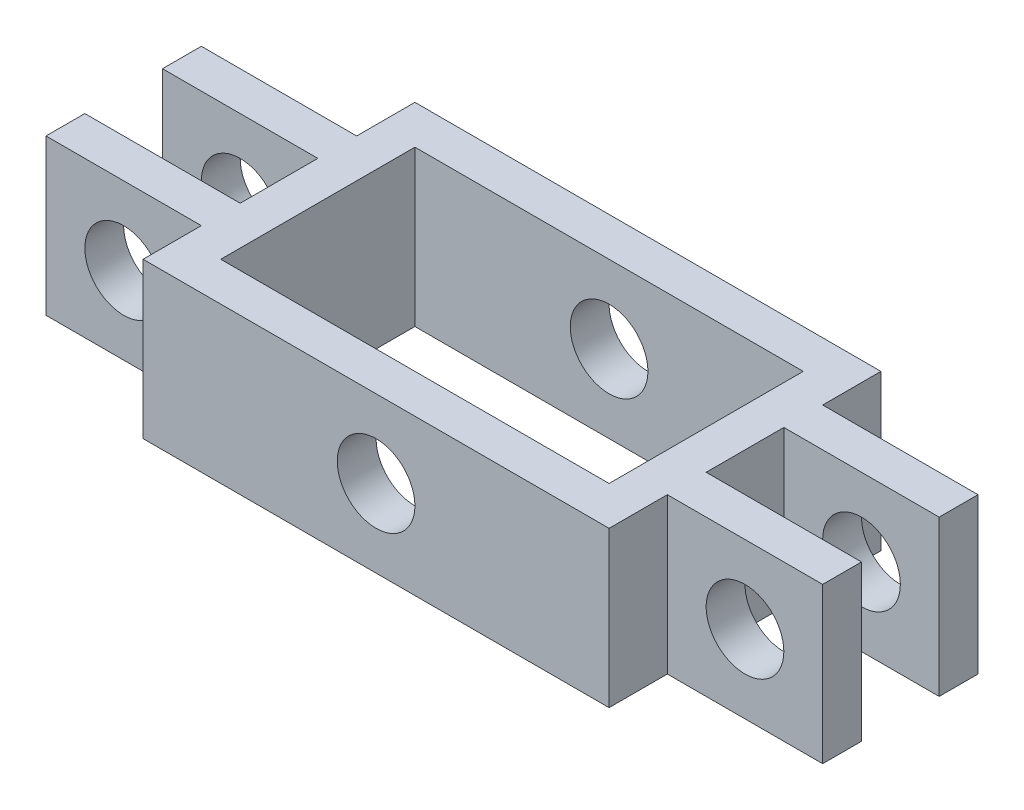
ISO-10303-21;
HEADER;
FILE_DESCRIPTION(('STEP AP214'),'2;1');
FILE_NAME('part.step','',(''),(''),'','','');
FILE_SCHEMA(('AUTOMOTIVE_DESIGN { 1 0 10303 214 1 1 1 1 }'));
ENDSEC;
DATA;
#1=APPLICATION_CONTEXT('core data for automotive mechanical design processes');
#2=APPLICATION_PROTOCOL_DEFINITION('international standard','automotive_design',2000,#1);
#3=PRODUCT_CONTEXT('',#1,'mechanical');
#4=PRODUCT('Part','Part','',(#3));
#5=PRODUCT_RELATED_PRODUCT_CATEGORY('part','',(#4));
#6=PRODUCT_DEFINITION_FORMATION('','',#4);
#7=PRODUCT_DEFINITION_CONTEXT('part definition',#1,'design');
#8=PRODUCT_DEFINITION('design','',#6,#7);
#9=PRODUCT_DEFINITION_SHAPE('','',#8);
#10=(LENGTH_UNIT() NAMED_UNIT(*) SI_UNIT(.MILLI.,.METRE.));
#11=(NAMED_UNIT(*) PLANE_ANGLE_UNIT() SI_UNIT($,.RADIAN.));
#12=(NAMED_UNIT(*) SI_UNIT($,.STERADIAN.) SOLID_ANGLE_UNIT());
#13=UNCERTAINTY_MEASURE_WITH_UNIT(LENGTH_MEASURE(1.E-05),#10,'distance_accuracy_value','');
#14=(GEOMETRIC_REPRESENTATION_CONTEXT(3) GLOBAL_UNCERTAINTY_ASSIGNED_CONTEXT((#13)) GLOBAL_UNIT_ASSIGNED_CONTEXT((#10,
#11,#12)) REPRESENTATION_CONTEXT('',''));
#15=CARTESIAN_POINT('',(0.,0.,0.));
#16=DIRECTION('',(0.,0.,1.));
#17=DIRECTION('',(1.,0.,0.));
#18=AXIS2_PLACEMENT_3D('',#15,#16,#17);
#19=CARTESIAN_POINT('',(-50.,0.,0.));
#20=DIRECTION('',(-1.,0.,0.));
#21=DIRECTION('',(0.,0.,1.));
#22=AXIS2_PLACEMENT_3D('',#19,#20,#21);
#23=PLANE('',#22);
#24=DIRECTION('',(0.,1.,0.));
#25=VECTOR('',#24,1.);
#26=CARTESIAN_POINT('',(-50.,0.,-5.));
#27=LINE('',#26,#25);
#28=CARTESIAN_POINT('',(-50.,0.,-5.));
#29=VERTEX_POINT('',#28);
#30=CARTESIAN_POINT('',(-50.,20.,-5.));
#31=VERTEX_POINT('',#30);
#32=EDGE_CURVE('E239',#29,#31,#27,.T.);
#33=ORIENTED_EDGE('',*,*,#32,.T.);
#34=DIRECTION('',(0.,0.,-1.));
#35=VECTOR('',#34,1.);
#36=CARTESIAN_POINT('',(-50.,20.,10.));
#37=LINE('',#36,#35);
#38=CARTESIAN_POINT('',(-50.,20.,-10.));
#39=VERTEX_POINT('',#38);
#40=EDGE_CURVE('E351',#31,#39,#37,.T.);
#41=ORIENTED_EDGE('',*,*,#40,.T.);
#42=DIRECTION('',(0.,-1.,0.));
#43=VECTOR('',#42,1.);
#44=CARTESIAN_POINT('',(-50.,0.,-10.));
#45=LINE('',#44,#43);
#46=CARTESIAN_POINT('',(-50.,0.,-10.));
#47=VERTEX_POINT('',#46);
#48=EDGE_CURVE('E338',#39,#47,#45,.T.);
#49=ORIENTED_EDGE('',*,*,#48,.T.);
#50=DIRECTION('',(0.,0.,1.));
#51=VECTOR('',#50,1.);
#52=CARTESIAN_POINT('',(-50.,0.,10.));
#53=LINE('',#52,#51);
#54=EDGE_CURVE('E344',#47,#29,#53,.T.);
#55=ORIENTED_EDGE('',*,*,#54,.T.);
#56=EDGE_LOOP('',(#33,#41,#49,#55));
#57=FACE_BOUND('',#56,.T.);
#58=ADVANCED_FACE('F39',(#57),#23,.T.);
#59=CARTESIAN_POINT('',(50.,0.,0.));
#60=DIRECTION('',(1.,0.,0.));
#61=DIRECTION('',(0.,0.,-1.));
#62=AXIS2_PLACEMENT_3D('',#59,#60,#61);
#63=PLANE('',#62);
#64=DIRECTION('',(0.,1.,0.));
#65=VECTOR('',#64,1.);
#66=CARTESIAN_POINT('',(50.,0.,4.99999999999999));
#67=LINE('',#66,#65);
#68=CARTESIAN_POINT('',(50.,0.,4.99999999999999));
#69=VERTEX_POINT('',#68);
#70=CARTESIAN_POINT('',(50.,20.,4.99999999999999));
#71=VERTEX_POINT('',#70);
#72=EDGE_CURVE('E242',#69,#71,#67,.T.);
#73=ORIENTED_EDGE('',*,*,#72,.T.);
#74=DIRECTION('',(0.,0.,1.));
#75=VECTOR('',#74,1.);
#76=CARTESIAN_POINT('',(50.,20.,10.));
#77=LINE('',#76,#75);
#78=CARTESIAN_POINT('',(50.,20.,10.));
#79=VERTEX_POINT('',#78);
#80=EDGE_CURVE('E310',#71,#79,#77,.T.);
#81=ORIENTED_EDGE('',*,*,#80,.T.);
#82=DIRECTION('',(0.,-1.,0.));
#83=VECTOR('',#82,1.);
#84=CARTESIAN_POINT('',(50.,20.,10.));
#85=LINE('',#84,#83);
#86=CARTESIAN_POINT('',(50.,0.,10.));
#87=VERTEX_POINT('',#86);
#88=EDGE_CURVE('E298',#79,#87,#85,.T.);
#89=ORIENTED_EDGE('',*,*,#88,.T.);
#90=DIRECTION('',(0.,0.,-1.));
#91=VECTOR('',#90,1.);
#92=CARTESIAN_POINT('',(50.,0.,10.));
#93=LINE('',#92,#91);
#94=EDGE_CURVE('E303',#87,#69,#93,.T.);
#95=ORIENTED_EDGE('',*,*,#94,.T.);
#96=EDGE_LOOP('',(#73,#81,#89,#95));
#97=FACE_BOUND('',#96,.T.);
#98=ADVANCED_FACE('F514',(#97),#63,.T.);
#99=CARTESIAN_POINT('',(40.,10.,-17.5));
#100=DIRECTION('',(0.,0.,1.));
#101=DIRECTION('',(1.,0.,0.));
#102=AXIS2_PLACEMENT_3D('',#99,#100,#101);
#103=CYLINDRICAL_SURFACE('',#102,5.);
#104=CARTESIAN_POINT('',(40.,10.,4.99999999999999));
#105=DIRECTION('',(0.,0.,1.));
#106=DIRECTION('',(1.,0.,0.));
#107=AXIS2_PLACEMENT_3D('',#104,#105,#106);
#108=CIRCLE('',#107,5.);
#109=CARTESIAN_POINT('',(45.,10.,4.99999999999999));
#110=VERTEX_POINT('',#109);
#111=EDGE_CURVE('E43',#110,#110,#108,.F.);
#112=ORIENTED_EDGE('',*,*,#111,.T.);
#113=EDGE_LOOP('',(#112));
#114=FACE_BOUND('',#113,.T.);
#115=CARTESIAN_POINT('',(40.,10.,10.));
#116=DIRECTION('',(0.,0.,1.));
#117=DIRECTION('',(1.,0.,0.));
#118=AXIS2_PLACEMENT_3D('',#115,#116,#117);
#119=CIRCLE('',#118,5.);
#120=CARTESIAN_POINT('',(45.,10.,10.));
#121=VERTEX_POINT('',#120);
#122=EDGE_CURVE('E289',#121,#121,#119,.T.);
#123=ORIENTED_EDGE('',*,*,#122,.T.);
#124=EDGE_LOOP('',(#123));
#125=FACE_BOUND('',#124,.T.);
#126=ADVANCED_FACE('F496',(#114,#125),#103,.F.);
#127=CARTESIAN_POINT('',(-40.,9.99999999999999,-17.5));
#128=DIRECTION('',(0.,0.,1.));
#129=DIRECTION('',(1.,0.,0.));
#130=AXIS2_PLACEMENT_3D('',#127,#128,#129);
#131=CYLINDRICAL_SURFACE('',#130,5.);
#132=CARTESIAN_POINT('',(-40.,9.99999999999999,-5.));
#133=DIRECTION('',(0.,0.,-1.));
#134=DIRECTION('',(-1.,0.,0.));
#135=AXIS2_PLACEMENT_3D('',#132,#133,#134);
#136=CIRCLE('',#135,5.);
#137=CARTESIAN_POINT('',(-45.,9.99999999999999,-5.));
#138=VERTEX_POINT('',#137);
#139=EDGE_CURVE('E484',#138,#138,#136,.F.);
#140=ORIENTED_EDGE('',*,*,#139,.T.);
#141=EDGE_LOOP('',(#140));
#142=FACE_BOUND('',#141,.T.);
#143=CARTESIAN_POINT('',(-40.,9.99999999999999,-10.));
#144=DIRECTION('',(0.,0.,1.));
#145=DIRECTION('',(0.,-1.,0.));
#146=AXIS2_PLACEMENT_3D('',#143,#144,#145);
#147=CIRCLE('',#146,5.);
#148=CARTESIAN_POINT('',(-40.,5.,-10.));
#149=VERTEX_POINT('',#148);
#150=EDGE_CURVE('E293',#149,#149,#147,.T.);
#151=ORIENTED_EDGE('',*,*,#150,.F.);
#152=EDGE_LOOP('',(#151));
#153=FACE_BOUND('',#152,.T.);
#154=ADVANCED_FACE('F609',(#142,#153),#131,.F.);
#155=CARTESIAN_POINT('',(30.,20.,17.5));
#156=DIRECTION('',(-1.,0.,0.));
#157=DIRECTION('',(0.,0.,1.));
#158=AXIS2_PLACEMENT_3D('',#155,#156,#157);
#159=PLANE('',#158);
#160=DIRECTION('',(0.,-1.,0.));
#161=VECTOR('',#160,1.);
#162=CARTESIAN_POINT('',(30.,20.,10.));
#163=LINE('',#162,#161);
#164=CARTESIAN_POINT('',(30.,20.,10.));
#165=VERTEX_POINT('',#164);
#166=CARTESIAN_POINT('',(30.,0.,10.));
#167=VERTEX_POINT('',#166);
#168=EDGE_CURVE('E297',#165,#167,#163,.T.);
#169=ORIENTED_EDGE('',*,*,#168,.F.);
#170=DIRECTION('',(0.,0.,-1.));
#171=VECTOR('',#170,1.);
#172=CARTESIAN_POINT('',(30.,20.,17.5));
#173=LINE('',#172,#171);
#174=CARTESIAN_POINT('',(30.,20.,17.5));
#175=VERTEX_POINT('',#174);
#176=EDGE_CURVE('E435',#175,#165,#173,.T.);
#177=ORIENTED_EDGE('',*,*,#176,.F.);
#178=DIRECTION('',(0.,-1.,0.));
#179=VECTOR('',#178,1.);
#180=CARTESIAN_POINT('',(30.,20.,17.5));
#181=LINE('',#180,#179);
#182=CARTESIAN_POINT('',(30.,0.,17.5));
#183=VERTEX_POINT('',#182);
#184=EDGE_CURVE('E451',#175,#183,#181,.T.);
#185=ORIENTED_EDGE('',*,*,#184,.T.);
#186=DIRECTION('',(0.,0.,-1.));
#187=VECTOR('',#186,1.);
#188=CARTESIAN_POINT('',(30.,0.,17.5));
#189=LINE('',#188,#187);
#190=EDGE_CURVE('E452',#183,#167,#189,.T.);
#191=ORIENTED_EDGE('',*,*,#190,.T.);
#192=EDGE_LOOP('',(#169,#177,#185,#191));
#193=FACE_BOUND('',#192,.T.);
#194=ADVANCED_FACE('F41',(#193),#159,.F.);
#195=DIRECTION('',(0.,1.,0.));
#196=VECTOR('',#195,1.);
#197=CARTESIAN_POINT('',(30.,20.,-10.));
#198=LINE('',#197,#196);
#199=CARTESIAN_POINT('',(30.,0.,-10.));
#200=VERTEX_POINT('',#199);
#201=CARTESIAN_POINT('',(30.,20.,-10.));
#202=VERTEX_POINT('',#201);
#203=EDGE_CURVE('E302',#200,#202,#198,.T.);
#204=ORIENTED_EDGE('',*,*,#203,.F.);
#205=CARTESIAN_POINT('',(30.,0.,-17.5));
#206=VERTEX_POINT('',#205);
#207=EDGE_CURVE('E434',#200,#206,#189,.T.);
#208=ORIENTED_EDGE('',*,*,#207,.T.);
#209=DIRECTION('',(0.,-1.,0.));
#210=VECTOR('',#209,1.);
#211=CARTESIAN_POINT('',(30.,20.,-17.5));
#212=LINE('',#211,#210);
#213=CARTESIAN_POINT('',(30.,20.,-17.5));
#214=VERTEX_POINT('',#213);
#215=EDGE_CURVE('E11',#214,#206,#212,.T.);
#216=ORIENTED_EDGE('',*,*,#215,.F.);
#217=EDGE_CURVE('E440',#202,#214,#173,.T.);
#218=ORIENTED_EDGE('',*,*,#217,.F.);
#219=EDGE_LOOP('',(#204,#208,#216,#218));
#220=FACE_BOUND('',#219,.T.);
#221=ADVANCED_FACE('F597',(#220),#159,.F.);
#222=CARTESIAN_POINT('',(-30.,20.,17.5));
#223=DIRECTION('',(1.,0.,0.));
#224=DIRECTION('',(0.,0.,-1.));
#225=AXIS2_PLACEMENT_3D('',#222,#223,#224);
#226=PLANE('',#225);
#227=DIRECTION('',(0.,-1.,0.));
#228=VECTOR('',#227,1.);
#229=CARTESIAN_POINT('',(-30.,0.,-10.));
#230=LINE('',#229,#228);
#231=CARTESIAN_POINT('',(-30.,20.,-10.));
#232=VERTEX_POINT('',#231);
#233=CARTESIAN_POINT('',(-30.,0.,-10.));
#234=VERTEX_POINT('',#233);
#235=EDGE_CURVE('E337',#232,#234,#230,.T.);
#236=ORIENTED_EDGE('',*,*,#235,.F.);
#237=DIRECTION('',(0.,0.,1.));
#238=VECTOR('',#237,1.);
#239=CARTESIAN_POINT('',(-30.,20.,17.5));
#240=LINE('',#239,#238);
#241=CARTESIAN_POINT('',(-30.,20.,-17.5));
#242=VERTEX_POINT('',#241);
#243=EDGE_CURVE('E444',#242,#232,#240,.T.);
#244=ORIENTED_EDGE('',*,*,#243,.F.);
#245=DIRECTION('',(0.,-1.,0.));
#246=VECTOR('',#245,1.);
#247=CARTESIAN_POINT('',(-30.,20.,-17.5));
#248=LINE('',#247,#246);
#249=CARTESIAN_POINT('',(-30.,0.,-17.5));
#250=VERTEX_POINT('',#249);
#251=EDGE_CURVE('E49',#242,#250,#248,.T.);
#252=ORIENTED_EDGE('',*,*,#251,.T.);
#253=DIRECTION('',(0.,0.,1.));
#254=VECTOR('',#253,1.);
#255=CARTESIAN_POINT('',(-30.,0.,17.5));
#256=LINE('',#255,#254);
#257=EDGE_CURVE('E459',#250,#234,#256,.T.);
#258=ORIENTED_EDGE('',*,*,#257,.T.);
#259=EDGE_LOOP('',(#236,#244,#252,#258));
#260=FACE_BOUND('',#259,.T.);
#261=ADVANCED_FACE('F589',(#260),#226,.F.);
#262=DIRECTION('',(0.,1.,0.));
#263=VECTOR('',#262,1.);
#264=CARTESIAN_POINT('',(-30.,0.,10.));
#265=LINE('',#264,#263);
#266=CARTESIAN_POINT('',(-30.,0.,10.));
#267=VERTEX_POINT('',#266);
#268=CARTESIAN_POINT('',(-30.,20.,10.));
#269=VERTEX_POINT('',#268);
#270=EDGE_CURVE('E343',#267,#269,#265,.T.);
#271=ORIENTED_EDGE('',*,*,#270,.F.);
#272=CARTESIAN_POINT('',(-30.,0.,17.5));
#273=VERTEX_POINT('',#272);
#274=EDGE_CURVE('E458',#267,#273,#256,.T.);
#275=ORIENTED_EDGE('',*,*,#274,.T.);
#276=DIRECTION('',(0.,-1.,0.));
#277=VECTOR('',#276,1.);
#278=CARTESIAN_POINT('',(-30.,20.,17.5));
#279=LINE('',#278,#277);
#280=CARTESIAN_POINT('',(-30.,20.,17.5));
#281=VERTEX_POINT('',#280);
#282=EDGE_CURVE('E468',#281,#273,#279,.T.);
#283=ORIENTED_EDGE('',*,*,#282,.F.);
#284=EDGE_CURVE('E443',#269,#281,#240,.T.);
#285=ORIENTED_EDGE('',*,*,#284,.F.);
#286=EDGE_LOOP('',(#271,#275,#283,#285));
#287=FACE_BOUND('',#286,.T.);
#288=ADVANCED_FACE('F645',(#287),#226,.F.);
#289=CARTESIAN_POINT('',(0.,20.,0.));
#290=DIRECTION('',(0.,-1.,0.));
#291=DIRECTION('',(0.,0.,-1.));
#292=AXIS2_PLACEMENT_3D('',#289,#290,#291);
#293=PLANE('',#292);
#294=ORIENTED_EDGE('',*,*,#80,.F.);
#295=DIRECTION('',(1.,0.,0.));
#296=VECTOR('',#295,1.);
#297=CARTESIAN_POINT('',(50.,20.,4.99999999999999));
#298=LINE('',#297,#296);
#299=CARTESIAN_POINT('',(30.,20.,4.99999999999999));
#300=VERTEX_POINT('',#299);
#301=EDGE_CURVE('E229',#300,#71,#298,.T.);
#302=ORIENTED_EDGE('',*,*,#301,.F.);
#303=DIRECTION('',(0.,0.,1.));
#304=VECTOR('',#303,1.);
#305=CARTESIAN_POINT('',(30.,20.,-5.00000000000001));
#306=LINE('',#305,#304);
#307=CARTESIAN_POINT('',(30.,20.,-5.00000000000001));
#308=VERTEX_POINT('',#307);
#309=EDGE_CURVE('E232',#308,#300,#306,.T.);
#310=ORIENTED_EDGE('',*,*,#309,.F.);
#311=DIRECTION('',(-1.,0.,0.));
#312=VECTOR('',#311,1.);
#313=CARTESIAN_POINT('',(50.,20.,-5.00000000000001));
#314=LINE('',#313,#312);
#315=CARTESIAN_POINT('',(50.,20.,-5.00000000000001));
#316=VERTEX_POINT('',#315);
#317=EDGE_CURVE('E206',#316,#308,#314,.T.);
#318=ORIENTED_EDGE('',*,*,#317,.F.);
#319=CARTESIAN_POINT('',(50.,20.,-10.));
#320=VERTEX_POINT('',#319);
#321=EDGE_CURVE('E311',#320,#316,#77,.T.);
#322=ORIENTED_EDGE('',*,*,#321,.F.);
#323=DIRECTION('',(-1.,0.,0.));
#324=VECTOR('',#323,1.);
#325=CARTESIAN_POINT('',(50.,20.,-10.));
#326=LINE('',#325,#324);
#327=EDGE_CURVE('E325',#320,#202,#326,.T.);
#328=ORIENTED_EDGE('',*,*,#327,.T.);
#329=ORIENTED_EDGE('',*,*,#217,.T.);
#330=DIRECTION('',(-1.,0.,0.));
#331=VECTOR('',#330,1.);
#332=CARTESIAN_POINT('',(-30.,20.,-17.5));
#333=LINE('',#332,#331);
#334=EDGE_CURVE('E439',#214,#242,#333,.T.);
#335=ORIENTED_EDGE('',*,*,#334,.T.);
#336=ORIENTED_EDGE('',*,*,#243,.T.);
#337=DIRECTION('',(1.,0.,0.));
#338=VECTOR('',#337,1.);
#339=CARTESIAN_POINT('',(-50.,20.,-10.));
#340=LINE('',#339,#338);
#341=EDGE_CURVE('E356',#39,#232,#340,.T.);
#342=ORIENTED_EDGE('',*,*,#341,.F.);
#343=ORIENTED_EDGE('',*,*,#40,.F.);
#344=DIRECTION('',(-1.,0.,0.));
#345=VECTOR('',#344,1.);
#346=CARTESIAN_POINT('',(-50.,20.,-5.));
#347=LINE('',#346,#345);
#348=CARTESIAN_POINT('',(-30.,20.,-5.));
#349=VERTEX_POINT('',#348);
#350=EDGE_CURVE('E254',#349,#31,#347,.T.);
#351=ORIENTED_EDGE('',*,*,#350,.F.);
#352=DIRECTION('',(0.,0.,-1.));
#353=VECTOR('',#352,1.);
#354=CARTESIAN_POINT('',(-30.,20.,-5.));
#355=LINE('',#354,#353);
#356=CARTESIAN_POINT('',(-30.,20.,5.));
#357=VERTEX_POINT('',#356);
#358=EDGE_CURVE('E267',#357,#349,#355,.T.);
#359=ORIENTED_EDGE('',*,*,#358,.F.);
#360=DIRECTION('',(1.,0.,0.));
#361=VECTOR('',#360,1.);
#362=CARTESIAN_POINT('',(-50.,20.,5.));
#363=LINE('',#362,#361);
#364=CARTESIAN_POINT('',(-50.,20.,5.));
#365=VERTEX_POINT('',#364);
#366=EDGE_CURVE('E263',#365,#357,#363,.T.);
#367=ORIENTED_EDGE('',*,*,#366,.F.);
#368=CARTESIAN_POINT('',(-50.,20.,10.));
#369=VERTEX_POINT('',#368);
#370=EDGE_CURVE('E352',#369,#365,#37,.T.);
#371=ORIENTED_EDGE('',*,*,#370,.F.);
#372=DIRECTION('',(1.,0.,0.));
#373=VECTOR('',#372,1.);
#374=CARTESIAN_POINT('',(-50.,20.,10.));
#375=LINE('',#374,#373);
#376=EDGE_CURVE('E366',#369,#269,#375,.T.);
#377=ORIENTED_EDGE('',*,*,#376,.T.);
#378=ORIENTED_EDGE('',*,*,#284,.T.);
#379=DIRECTION('',(1.,0.,0.));
#380=VECTOR('',#379,1.);
#381=CARTESIAN_POINT('',(-30.,20.,17.5));
#382=LINE('',#381,#380);
#383=EDGE_CURVE('E448',#281,#175,#382,.T.);
#384=ORIENTED_EDGE('',*,*,#383,.T.);
#385=ORIENTED_EDGE('',*,*,#176,.T.);
#386=DIRECTION('',(-1.,0.,0.));
#387=VECTOR('',#386,1.);
#388=CARTESIAN_POINT('',(50.,20.,10.));
#389=LINE('',#388,#387);
#390=EDGE_CURVE('E315',#79,#165,#389,.T.);
#391=ORIENTED_EDGE('',*,*,#390,.F.);
#392=EDGE_LOOP('',(#294,#302,#310,#318,#322,#328,#329,#335,#336,#342,#343,#351,#359,#367,#371,
#377,#378,#384,#385,#391));
#393=FACE_BOUND('',#392,.T.);
#394=DIRECTION('',(0.,0.,-1.));
#395=VECTOR('',#394,1.);
#396=CARTESIAN_POINT('',(25.,20.,12.5));
#397=LINE('',#396,#395);
#398=CARTESIAN_POINT('',(25.,20.,12.5));
#399=VERTEX_POINT('',#398);
#400=CARTESIAN_POINT('',(25.,20.,-12.5));
#401=VERTEX_POINT('',#400);
#402=EDGE_CURVE('E392',#399,#401,#397,.T.);
#403=ORIENTED_EDGE('',*,*,#402,.F.);
#404=DIRECTION('',(1.,0.,0.));
#405=VECTOR('',#404,1.);
#406=CARTESIAN_POINT('',(-25.,20.,12.5));
#407=LINE('',#406,#405);
#408=CARTESIAN_POINT('',(-25.,20.,12.5));
#409=VERTEX_POINT('',#408);
#410=EDGE_CURVE('E403',#409,#399,#407,.T.);
#411=ORIENTED_EDGE('',*,*,#410,.F.);
#412=DIRECTION('',(0.,0.,1.));
#413=VECTOR('',#412,1.);
#414=CARTESIAN_POINT('',(-25.,20.,12.5));
#415=LINE('',#414,#413);
#416=CARTESIAN_POINT('',(-25.,20.,-12.5));
#417=VERTEX_POINT('',#416);
#418=EDGE_CURVE('E399',#417,#409,#415,.T.);
#419=ORIENTED_EDGE('',*,*,#418,.F.);
#420=DIRECTION('',(-1.,0.,0.));
#421=VECTOR('',#420,1.);
#422=CARTESIAN_POINT('',(-25.,20.,-12.5));
#423=LINE('',#422,#421);
#424=EDGE_CURVE('E395',#401,#417,#423,.T.);
#425=ORIENTED_EDGE('',*,*,#424,.F.);
#426=EDGE_LOOP('',(#403,#411,#419,#425));
#427=FACE_BOUND('',#426,.T.);
#428=ADVANCED_FACE('F556',(#393,#427),#293,.F.);
#429=CARTESIAN_POINT('',(0.,0.,0.));
#430=DIRECTION('',(0.,-1.,0.));
#431=DIRECTION('',(0.,0.,-1.));
#432=AXIS2_PLACEMENT_3D('',#429,#430,#431);
#433=PLANE('',#432);
#434=DIRECTION('',(1.,0.,0.));
#435=VECTOR('',#434,1.);
#436=CARTESIAN_POINT('',(50.,0.,4.99999999999999));
#437=LINE('',#436,#435);
#438=CARTESIAN_POINT('',(30.,0.,4.99999999999999));
#439=VERTEX_POINT('',#438);
#440=EDGE_CURVE('E221',#439,#69,#437,.T.);
#441=ORIENTED_EDGE('',*,*,#440,.T.);
#442=ORIENTED_EDGE('',*,*,#94,.F.);
#443=DIRECTION('',(-1.,0.,0.));
#444=VECTOR('',#443,1.);
#445=CARTESIAN_POINT('',(50.,0.,10.));
#446=LINE('',#445,#444);
#447=EDGE_CURVE('E333',#87,#167,#446,.T.);
#448=ORIENTED_EDGE('',*,*,#447,.T.);
#449=ORIENTED_EDGE('',*,*,#190,.F.);
#450=DIRECTION('',(1.,0.,0.));
#451=VECTOR('',#450,1.);
#452=CARTESIAN_POINT('',(-30.,0.,17.5));
#453=LINE('',#452,#451);
#454=EDGE_CURVE('E462',#273,#183,#453,.T.);
#455=ORIENTED_EDGE('',*,*,#454,.F.);
#456=ORIENTED_EDGE('',*,*,#274,.F.);
#457=DIRECTION('',(1.,0.,0.));
#458=VECTOR('',#457,1.);
#459=CARTESIAN_POINT('',(-50.,0.,10.));
#460=LINE('',#459,#458);
#461=CARTESIAN_POINT('',(-50.,0.,10.));
#462=VERTEX_POINT('',#461);
#463=EDGE_CURVE('E370',#462,#267,#460,.T.);
#464=ORIENTED_EDGE('',*,*,#463,.F.);
#465=CARTESIAN_POINT('',(-50.,0.,5.));
#466=VERTEX_POINT('',#465);
#467=EDGE_CURVE('E342',#466,#462,#53,.T.);
#468=ORIENTED_EDGE('',*,*,#467,.F.);
#469=DIRECTION('',(1.,0.,0.));
#470=VECTOR('',#469,1.);
#471=CARTESIAN_POINT('',(-50.,0.,5.));
#472=LINE('',#471,#470);
#473=CARTESIAN_POINT('',(-30.,0.,5.));
#474=VERTEX_POINT('',#473);
#475=EDGE_CURVE('E57',#466,#474,#472,.T.);
#476=ORIENTED_EDGE('',*,*,#475,.T.);
#477=DIRECTION('',(0.,0.,-1.));
#478=VECTOR('',#477,1.);
#479=CARTESIAN_POINT('',(-30.,0.,-5.));
#480=LINE('',#479,#478);
#481=CARTESIAN_POINT('',(-30.,0.,-5.));
#482=VERTEX_POINT('',#481);
#483=EDGE_CURVE('E253',#474,#482,#480,.T.);
#484=ORIENTED_EDGE('',*,*,#483,.T.);
#485=DIRECTION('',(-1.,0.,0.));
#486=VECTOR('',#485,1.);
#487=CARTESIAN_POINT('',(-50.,0.,-5.));
#488=LINE('',#487,#486);
#489=EDGE_CURVE('E258',#482,#29,#488,.T.);
#490=ORIENTED_EDGE('',*,*,#489,.T.);
#491=ORIENTED_EDGE('',*,*,#54,.F.);
#492=DIRECTION('',(1.,0.,0.));
#493=VECTOR('',#492,1.);
#494=CARTESIAN_POINT('',(-50.,0.,-10.));
#495=LINE('',#494,#493);
#496=EDGE_CURVE('E374',#47,#234,#495,.T.);
#497=ORIENTED_EDGE('',*,*,#496,.T.);
#498=ORIENTED_EDGE('',*,*,#257,.F.);
#499=DIRECTION('',(-1.,0.,0.));
#500=VECTOR('',#499,1.);
#501=CARTESIAN_POINT('',(-30.,0.,-17.5));
#502=LINE('',#501,#500);
#503=EDGE_CURVE('E455',#206,#250,#502,.T.);
#504=ORIENTED_EDGE('',*,*,#503,.F.);
#505=ORIENTED_EDGE('',*,*,#207,.F.);
#506=DIRECTION('',(-1.,0.,0.));
#507=VECTOR('',#506,1.);
#508=CARTESIAN_POINT('',(50.,0.,-10.));
#509=LINE('',#508,#507);
#510=CARTESIAN_POINT('',(50.,0.,-10.));
#511=VERTEX_POINT('',#510);
#512=EDGE_CURVE('E329',#511,#200,#509,.T.);
#513=ORIENTED_EDGE('',*,*,#512,.F.);
#514=CARTESIAN_POINT('',(50.,0.,-5.00000000000001));
#515=VERTEX_POINT('',#514);
#516=EDGE_CURVE('E227',#515,#511,#93,.T.);
#517=ORIENTED_EDGE('',*,*,#516,.F.);
#518=DIRECTION('',(-1.,0.,0.));
#519=VECTOR('',#518,1.);
#520=CARTESIAN_POINT('',(50.,0.,-5.00000000000001));
#521=LINE('',#520,#519);
#522=CARTESIAN_POINT('',(30.,0.,-5.00000000000001));
#523=VERTEX_POINT('',#522);
#524=EDGE_CURVE('E65',#515,#523,#521,.T.);
#525=ORIENTED_EDGE('',*,*,#524,.T.);
#526=DIRECTION('',(0.,0.,1.));
#527=VECTOR('',#526,1.);
#528=CARTESIAN_POINT('',(30.,0.,-5.00000000000001));
#529=LINE('',#528,#527);
#530=EDGE_CURVE('E215',#523,#439,#529,.T.);
#531=ORIENTED_EDGE('',*,*,#530,.T.);
#532=EDGE_LOOP('',(#441,#442,#448,#449,#455,#456,#464,#468,#476,#484,#490,#491,#497,#498,#504,
#505,#513,#517,#525,#531));
#533=FACE_BOUND('',#532,.T.);
#534=DIRECTION('',(1.,0.,0.));
#535=VECTOR('',#534,1.);
#536=CARTESIAN_POINT('',(-25.,0.,12.5));
#537=LINE('',#536,#535);
#538=CARTESIAN_POINT('',(-25.,0.,12.5));
#539=VERTEX_POINT('',#538);
#540=CARTESIAN_POINT('',(25.,0.,12.5));
#541=VERTEX_POINT('',#540);
#542=EDGE_CURVE('E396',#539,#541,#537,.T.);
#543=ORIENTED_EDGE('',*,*,#542,.T.);
#544=DIRECTION('',(0.,0.,-1.));
#545=VECTOR('',#544,1.);
#546=CARTESIAN_POINT('',(25.,0.,12.5));
#547=LINE('',#546,#545);
#548=CARTESIAN_POINT('',(25.,0.,-12.5));
#549=VERTEX_POINT('',#548);
#550=EDGE_CURVE('E391',#541,#549,#547,.T.);
#551=ORIENTED_EDGE('',*,*,#550,.T.);
#552=DIRECTION('',(-1.,0.,0.));
#553=VECTOR('',#552,1.);
#554=CARTESIAN_POINT('',(-25.,0.,-12.5));
#555=LINE('',#554,#553);
#556=CARTESIAN_POINT('',(-25.,0.,-12.5));
#557=VERTEX_POINT('',#556);
#558=EDGE_CURVE('E410',#549,#557,#555,.T.);
#559=ORIENTED_EDGE('',*,*,#558,.T.);
#560=DIRECTION('',(0.,0.,1.));
#561=VECTOR('',#560,1.);
#562=CARTESIAN_POINT('',(-25.,0.,12.5));
#563=LINE('',#562,#561);
#564=EDGE_CURVE('E414',#557,#539,#563,.T.);
#565=ORIENTED_EDGE('',*,*,#564,.T.);
#566=EDGE_LOOP('',(#543,#551,#559,#565));
#567=FACE_BOUND('',#566,.T.);
#568=ADVANCED_FACE('F224',(#533,#567),#433,.T.);
#569=CARTESIAN_POINT('',(-30.,20.,-17.5));
#570=DIRECTION('',(0.,0.,1.));
#571=DIRECTION('',(1.,0.,0.));
#572=AXIS2_PLACEMENT_3D('',#569,#570,#571);
#573=PLANE('',#572);
#574=CARTESIAN_POINT('',(0.,10.,-17.5));
#575=DIRECTION('',(0.,0.,1.));
#576=DIRECTION('',(1.,0.,0.));
#577=AXIS2_PLACEMENT_3D('',#574,#575,#576);
#578=CIRCLE('',#577,5.);
#579=CARTESIAN_POINT('',(5.,10.,-17.5));
#580=VERTEX_POINT('',#579);
#581=EDGE_CURVE('E379',#580,#580,#578,.T.);
#582=ORIENTED_EDGE('',*,*,#581,.T.);
#583=EDGE_LOOP('',(#582));
#584=FACE_BOUND('',#583,.T.);
#585=ORIENTED_EDGE('',*,*,#503,.T.);
#586=ORIENTED_EDGE('',*,*,#251,.F.);
#587=ORIENTED_EDGE('',*,*,#334,.F.);
#588=ORIENTED_EDGE('',*,*,#215,.T.);
#589=EDGE_LOOP('',(#585,#586,#587,#588));
#590=FACE_BOUND('',#589,.T.);
#591=ADVANCED_FACE('F594',(#584,#590),#573,.F.);
#592=CARTESIAN_POINT('',(-30.,20.,17.5));
#593=DIRECTION('',(0.,0.,-1.));
#594=DIRECTION('',(-1.,0.,0.));
#595=AXIS2_PLACEMENT_3D('',#592,#593,#594);
#596=PLANE('',#595);
#597=CARTESIAN_POINT('',(0.,10.,17.5));
#598=DIRECTION('',(0.,0.,1.));
#599=DIRECTION('',(1.,0.,0.));
#600=AXIS2_PLACEMENT_3D('',#597,#598,#599);
#601=CIRCLE('',#600,5.);
#602=CARTESIAN_POINT('',(5.,10.,17.5));
#603=VERTEX_POINT('',#602);
#604=EDGE_CURVE('E378',#603,#603,#601,.T.);
#605=ORIENTED_EDGE('',*,*,#604,.F.);
#606=EDGE_LOOP('',(#605));
#607=FACE_BOUND('',#606,.T.);
#608=ORIENTED_EDGE('',*,*,#454,.T.);
#609=ORIENTED_EDGE('',*,*,#184,.F.);
#610=ORIENTED_EDGE('',*,*,#383,.F.);
#611=ORIENTED_EDGE('',*,*,#282,.T.);
#612=EDGE_LOOP('',(#608,#609,#610,#611));
#613=FACE_BOUND('',#612,.T.);
#614=ADVANCED_FACE('F571',(#607,#613),#596,.F.);
#615=CARTESIAN_POINT('',(25.,20.,12.5));
#616=DIRECTION('',(-1.,0.,0.));
#617=DIRECTION('',(0.,0.,1.));
#618=AXIS2_PLACEMENT_3D('',#615,#616,#617);
#619=PLANE('',#618);
#620=ORIENTED_EDGE('',*,*,#550,.F.);
#621=DIRECTION('',(0.,-1.,0.));
#622=VECTOR('',#621,1.);
#623=CARTESIAN_POINT('',(25.,20.,12.5));
#624=LINE('',#623,#622);
#625=EDGE_CURVE('E406',#399,#541,#624,.T.);
#626=ORIENTED_EDGE('',*,*,#625,.F.);
#627=ORIENTED_EDGE('',*,*,#402,.T.);
#628=DIRECTION('',(0.,-1.,0.));
#629=VECTOR('',#628,1.);
#630=CARTESIAN_POINT('',(25.,20.,-12.5));
#631=LINE('',#630,#629);
#632=EDGE_CURVE('E430',#401,#549,#631,.T.);
#633=ORIENTED_EDGE('',*,*,#632,.T.);
#634=EDGE_LOOP('',(#620,#626,#627,#633));
#635=FACE_BOUND('',#634,.T.);
#636=ADVANCED_FACE('F638',(#635),#619,.T.);
#637=CARTESIAN_POINT('',(-25.,20.,-12.5));
#638=DIRECTION('',(0.,0.,1.));
#639=DIRECTION('',(1.,0.,0.));
#640=AXIS2_PLACEMENT_3D('',#637,#638,#639);
#641=PLANE('',#640);
#642=CARTESIAN_POINT('',(0.,10.,-12.5));
#643=DIRECTION('',(0.,0.,1.));
#644=DIRECTION('',(1.,0.,0.));
#645=AXIS2_PLACEMENT_3D('',#642,#643,#644);
#646=CIRCLE('',#645,5.);
#647=CARTESIAN_POINT('',(5.,10.,-12.5));
#648=VERTEX_POINT('',#647);
#649=EDGE_CURVE('E387',#648,#648,#646,.T.);
#650=ORIENTED_EDGE('',*,*,#649,.F.);
#651=EDGE_LOOP('',(#650));
#652=FACE_BOUND('',#651,.T.);
#653=ORIENTED_EDGE('',*,*,#558,.F.);
#654=ORIENTED_EDGE('',*,*,#632,.F.);
#655=ORIENTED_EDGE('',*,*,#424,.T.);
#656=DIRECTION('',(0.,-1.,0.));
#657=VECTOR('',#656,1.);
#658=CARTESIAN_POINT('',(-25.,20.,-12.5));
#659=LINE('',#658,#657);
#660=EDGE_CURVE('E427',#417,#557,#659,.T.);
#661=ORIENTED_EDGE('',*,*,#660,.T.);
#662=EDGE_LOOP('',(#653,#654,#655,#661));
#663=FACE_BOUND('',#662,.T.);
#664=ADVANCED_FACE('F634',(#652,#663),#641,.T.);
#665=CARTESIAN_POINT('',(-25.,20.,12.5));
#666=DIRECTION('',(1.,0.,0.));
#667=DIRECTION('',(0.,0.,-1.));
#668=AXIS2_PLACEMENT_3D('',#665,#666,#667);
#669=PLANE('',#668);
#670=ORIENTED_EDGE('',*,*,#564,.F.);
#671=ORIENTED_EDGE('',*,*,#660,.F.);
#672=ORIENTED_EDGE('',*,*,#418,.T.);
#673=DIRECTION('',(0.,-1.,0.));
#674=VECTOR('',#673,1.);
#675=CARTESIAN_POINT('',(-25.,20.,12.5));
#676=LINE('',#675,#674);
#677=EDGE_CURVE('E424',#409,#539,#676,.T.);
#678=ORIENTED_EDGE('',*,*,#677,.T.);
#679=EDGE_LOOP('',(#670,#671,#672,#678));
#680=FACE_BOUND('',#679,.T.);
#681=ADVANCED_FACE('F630',(#680),#669,.T.);
#682=CARTESIAN_POINT('',(-25.,20.,12.5));
#683=DIRECTION('',(0.,0.,-1.));
#684=DIRECTION('',(-1.,0.,0.));
#685=AXIS2_PLACEMENT_3D('',#682,#683,#684);
#686=PLANE('',#685);
#687=CARTESIAN_POINT('',(0.,10.,12.5));
#688=DIRECTION('',(0.,0.,-1.));
#689=DIRECTION('',(-1.,0.,0.));
#690=AXIS2_PLACEMENT_3D('',#687,#688,#689);
#691=CIRCLE('',#690,5.);
#692=CARTESIAN_POINT('',(-5.,10.,12.5));
#693=VERTEX_POINT('',#692);
#694=EDGE_CURVE('E383',#693,#693,#691,.T.);
#695=ORIENTED_EDGE('',*,*,#694,.F.);
#696=EDGE_LOOP('',(#695));
#697=FACE_BOUND('',#696,.T.);
#698=ORIENTED_EDGE('',*,*,#542,.F.);
#699=ORIENTED_EDGE('',*,*,#677,.F.);
#700=ORIENTED_EDGE('',*,*,#410,.T.);
#701=ORIENTED_EDGE('',*,*,#625,.T.);
#702=EDGE_LOOP('',(#698,#699,#700,#701));
#703=FACE_BOUND('',#702,.T.);
#704=ADVANCED_FACE('F626',(#697,#703),#686,.T.);
#705=CARTESIAN_POINT('',(0.,10.,-17.5));
#706=DIRECTION('',(0.,0.,1.));
#707=DIRECTION('',(1.,0.,0.));
#708=AXIS2_PLACEMENT_3D('',#705,#706,#707);
#709=CYLINDRICAL_SURFACE('',#708,5.);
#710=ORIENTED_EDGE('',*,*,#694,.T.);
#711=EDGE_LOOP('',(#710));
#712=FACE_BOUND('',#711,.T.);
#713=ORIENTED_EDGE('',*,*,#604,.T.);
#714=EDGE_LOOP('',(#713));
#715=FACE_BOUND('',#714,.T.);
#716=ADVANCED_FACE('F621',(#712,#715),#709,.F.);
#717=ORIENTED_EDGE('',*,*,#649,.T.);
#718=EDGE_LOOP('',(#717));
#719=FACE_BOUND('',#718,.T.);
#720=ORIENTED_EDGE('',*,*,#581,.F.);
#721=EDGE_LOOP('',(#720));
#722=FACE_BOUND('',#721,.T.);
#723=ADVANCED_FACE('F616',(#719,#722),#709,.F.);
#724=CARTESIAN_POINT('',(-50.,0.,-10.));
#725=DIRECTION('',(0.,0.,1.));
#726=DIRECTION('',(0.,-1.,0.));
#727=AXIS2_PLACEMENT_3D('',#724,#725,#726);
#728=PLANE('',#727);
#729=ORIENTED_EDGE('',*,*,#150,.T.);
#730=EDGE_LOOP('',(#729));
#731=FACE_BOUND('',#730,.T.);
#732=ORIENTED_EDGE('',*,*,#235,.T.);
#733=ORIENTED_EDGE('',*,*,#496,.F.);
#734=ORIENTED_EDGE('',*,*,#48,.F.);
#735=ORIENTED_EDGE('',*,*,#341,.T.);
#736=EDGE_LOOP('',(#732,#733,#734,#735));
#737=FACE_BOUND('',#736,.T.);
#738=ADVANCED_FACE('F536',(#731,#737),#728,.F.);
#739=CARTESIAN_POINT('',(-50.,0.,10.));
#740=DIRECTION('',(0.,0.,-1.));
#741=DIRECTION('',(-1.,0.,0.));
#742=AXIS2_PLACEMENT_3D('',#739,#740,#741);
#743=PLANE('',#742);
#744=CARTESIAN_POINT('',(-40.,9.99999999999999,10.));
#745=DIRECTION('',(0.,0.,1.));
#746=DIRECTION('',(1.,0.,0.));
#747=AXIS2_PLACEMENT_3D('',#744,#745,#746);
#748=CIRCLE('',#747,5.);
#749=CARTESIAN_POINT('',(-35.,9.99999999999999,10.));
#750=VERTEX_POINT('',#749);
#751=EDGE_CURVE('E284',#750,#750,#748,.T.);
#752=ORIENTED_EDGE('',*,*,#751,.F.);
#753=EDGE_LOOP('',(#752));
#754=FACE_BOUND('',#753,.T.);
#755=ORIENTED_EDGE('',*,*,#270,.T.);
#756=ORIENTED_EDGE('',*,*,#376,.F.);
#757=DIRECTION('',(0.,1.,0.));
#758=VECTOR('',#757,1.);
#759=CARTESIAN_POINT('',(-50.,0.,10.));
#760=LINE('',#759,#758);
#761=EDGE_CURVE('E348',#462,#369,#760,.T.);
#762=ORIENTED_EDGE('',*,*,#761,.F.);
#763=ORIENTED_EDGE('',*,*,#463,.T.);
#764=EDGE_LOOP('',(#755,#756,#762,#763));
#765=FACE_BOUND('',#764,.T.);
#766=ADVANCED_FACE('F528',(#754,#765),#743,.F.);
#767=DIRECTION('',(0.,1.,0.));
#768=VECTOR('',#767,1.);
#769=CARTESIAN_POINT('',(-50.,0.,5.));
#770=LINE('',#769,#768);
#771=EDGE_CURVE('E262',#466,#365,#770,.T.);
#772=ORIENTED_EDGE('',*,*,#771,.F.);
#773=ORIENTED_EDGE('',*,*,#467,.T.);
#774=ORIENTED_EDGE('',*,*,#761,.T.);
#775=ORIENTED_EDGE('',*,*,#370,.T.);
#776=EDGE_LOOP('',(#772,#773,#774,#775));
#777=FACE_BOUND('',#776,.T.);
#778=ADVANCED_FACE('F517',(#777),#23,.T.);
#779=CARTESIAN_POINT('',(50.,20.,10.));
#780=DIRECTION('',(0.,0.,-1.));
#781=DIRECTION('',(-1.,0.,0.));
#782=AXIS2_PLACEMENT_3D('',#779,#780,#781);
#783=PLANE('',#782);
#784=ORIENTED_EDGE('',*,*,#122,.F.);
#785=EDGE_LOOP('',(#784));
#786=FACE_BOUND('',#785,.T.);
#787=ORIENTED_EDGE('',*,*,#168,.T.);
#788=ORIENTED_EDGE('',*,*,#447,.F.);
#789=ORIENTED_EDGE('',*,*,#88,.F.);
#790=ORIENTED_EDGE('',*,*,#390,.T.);
#791=EDGE_LOOP('',(#787,#788,#789,#790));
#792=FACE_BOUND('',#791,.T.);
#793=ADVANCED_FACE('F527',(#786,#792),#783,.F.);
#794=CARTESIAN_POINT('',(50.,20.,-10.));
#795=DIRECTION('',(0.,0.,1.));
#796=DIRECTION('',(1.,0.,0.));
#797=AXIS2_PLACEMENT_3D('',#794,#795,#796);
#798=PLANE('',#797);
#799=CARTESIAN_POINT('',(40.,10.,-10.));
#800=DIRECTION('',(0.,0.,1.));
#801=DIRECTION('',(1.,0.,0.));
#802=AXIS2_PLACEMENT_3D('',#799,#800,#801);
#803=CIRCLE('',#802,5.);
#804=CARTESIAN_POINT('',(45.,10.,-10.));
#805=VERTEX_POINT('',#804);
#806=EDGE_CURVE('E288',#805,#805,#803,.T.);
#807=ORIENTED_EDGE('',*,*,#806,.T.);
#808=EDGE_LOOP('',(#807));
#809=FACE_BOUND('',#808,.T.);
#810=ORIENTED_EDGE('',*,*,#203,.T.);
#811=ORIENTED_EDGE('',*,*,#327,.F.);
#812=DIRECTION('',(0.,1.,0.));
#813=VECTOR('',#812,1.);
#814=CARTESIAN_POINT('',(50.,20.,-10.));
#815=LINE('',#814,#813);
#816=EDGE_CURVE('E307',#511,#320,#815,.T.);
#817=ORIENTED_EDGE('',*,*,#816,.F.);
#818=ORIENTED_EDGE('',*,*,#512,.T.);
#819=EDGE_LOOP('',(#810,#811,#817,#818));
#820=FACE_BOUND('',#819,.T.);
#821=ADVANCED_FACE('F534',(#809,#820),#798,.F.);
#822=DIRECTION('',(0.,1.,0.));
#823=VECTOR('',#822,1.);
#824=CARTESIAN_POINT('',(50.,0.,-5.00000000000001));
#825=LINE('',#824,#823);
#826=EDGE_CURVE('E212',#515,#316,#825,.T.);
#827=ORIENTED_EDGE('',*,*,#826,.F.);
#828=ORIENTED_EDGE('',*,*,#516,.T.);
#829=ORIENTED_EDGE('',*,*,#816,.T.);
#830=ORIENTED_EDGE('',*,*,#321,.T.);
#831=EDGE_LOOP('',(#827,#828,#829,#830));
#832=FACE_BOUND('',#831,.T.);
#833=ADVANCED_FACE('F523',(#832),#63,.T.);
#834=CARTESIAN_POINT('',(40.,10.,-5.00000000000001));
#835=DIRECTION('',(0.,0.,-1.));
#836=DIRECTION('',(-1.,0.,0.));
#837=AXIS2_PLACEMENT_3D('',#834,#835,#836);
#838=CIRCLE('',#837,5.);
#839=CARTESIAN_POINT('',(35.,10.,-5.00000000000001));
#840=VERTEX_POINT('',#839);
#841=EDGE_CURVE('E487',#840,#840,#838,.F.);
#842=ORIENTED_EDGE('',*,*,#841,.T.);
#843=EDGE_LOOP('',(#842));
#844=FACE_BOUND('',#843,.T.);
#845=ORIENTED_EDGE('',*,*,#806,.F.);
#846=EDGE_LOOP('',(#845));
#847=FACE_BOUND('',#846,.T.);
#848=ADVANCED_FACE('F768',(#844,#847),#103,.F.);
#849=CARTESIAN_POINT('',(-40.,9.99999999999999,5.));
#850=DIRECTION('',(0.,0.,1.));
#851=DIRECTION('',(1.,0.,0.));
#852=AXIS2_PLACEMENT_3D('',#849,#850,#851);
#853=CIRCLE('',#852,5.);
#854=CARTESIAN_POINT('',(-35.,9.99999999999999,5.));
#855=VERTEX_POINT('',#854);
#856=EDGE_CURVE('E246',#855,#855,#853,.F.);
#857=ORIENTED_EDGE('',*,*,#856,.T.);
#858=EDGE_LOOP('',(#857));
#859=FACE_BOUND('',#858,.T.);
#860=ORIENTED_EDGE('',*,*,#751,.T.);
#861=EDGE_LOOP('',(#860));
#862=FACE_BOUND('',#861,.T.);
#863=ADVANCED_FACE('F605',(#859,#862),#131,.F.);
#864=CARTESIAN_POINT('',(-50.,0.,-5.));
#865=DIRECTION('',(0.,0.,-1.));
#866=DIRECTION('',(-1.,0.,0.));
#867=AXIS2_PLACEMENT_3D('',#864,#865,#866);
#868=PLANE('',#867);
#869=ORIENTED_EDGE('',*,*,#350,.T.);
#870=ORIENTED_EDGE('',*,*,#32,.F.);
#871=ORIENTED_EDGE('',*,*,#489,.F.);
#872=DIRECTION('',(0.,1.,0.));
#873=VECTOR('',#872,1.);
#874=CARTESIAN_POINT('',(-30.,0.,-5.));
#875=LINE('',#874,#873);
#876=EDGE_CURVE('E276',#482,#349,#875,.T.);
#877=ORIENTED_EDGE('',*,*,#876,.T.);
#878=EDGE_LOOP('',(#869,#870,#871,#877));
#879=FACE_BOUND('',#878,.T.);
#880=ORIENTED_EDGE('',*,*,#139,.F.);
#881=EDGE_LOOP('',(#880));
#882=FACE_BOUND('',#881,.T.);
#883=ADVANCED_FACE('F602',(#879,#882),#868,.F.);
#884=CARTESIAN_POINT('',(-50.,0.,5.));
#885=DIRECTION('',(0.,0.,1.));
#886=DIRECTION('',(1.,0.,0.));
#887=AXIS2_PLACEMENT_3D('',#884,#885,#886);
#888=PLANE('',#887);
#889=ORIENTED_EDGE('',*,*,#366,.T.);
#890=DIRECTION('',(0.,1.,0.));
#891=VECTOR('',#890,1.);
#892=CARTESIAN_POINT('',(-30.,0.,5.));
#893=LINE('',#892,#891);
#894=EDGE_CURVE('E279',#474,#357,#893,.T.);
#895=ORIENTED_EDGE('',*,*,#894,.F.);
#896=ORIENTED_EDGE('',*,*,#475,.F.);
#897=ORIENTED_EDGE('',*,*,#771,.T.);
#898=EDGE_LOOP('',(#889,#895,#896,#897));
#899=FACE_BOUND('',#898,.T.);
#900=ORIENTED_EDGE('',*,*,#856,.F.);
#901=EDGE_LOOP('',(#900));
#902=FACE_BOUND('',#901,.T.);
#903=ADVANCED_FACE('F509',(#899,#902),#888,.F.);
#904=CARTESIAN_POINT('',(-30.,0.,-5.));
#905=DIRECTION('',(1.,0.,0.));
#906=DIRECTION('',(0.,0.,-1.));
#907=AXIS2_PLACEMENT_3D('',#904,#905,#906);
#908=PLANE('',#907);
#909=ORIENTED_EDGE('',*,*,#358,.T.);
#910=ORIENTED_EDGE('',*,*,#876,.F.);
#911=ORIENTED_EDGE('',*,*,#483,.F.);
#912=ORIENTED_EDGE('',*,*,#894,.T.);
#913=EDGE_LOOP('',(#909,#910,#911,#912));
#914=FACE_BOUND('',#913,.T.);
#915=ADVANCED_FACE('F501',(#914),#908,.F.);
#916=CARTESIAN_POINT('',(50.,0.,4.99999999999999));
#917=DIRECTION('',(0.,0.,1.));
#918=DIRECTION('',(1.,0.,0.));
#919=AXIS2_PLACEMENT_3D('',#916,#917,#918);
#920=PLANE('',#919);
#921=ORIENTED_EDGE('',*,*,#301,.T.);
#922=ORIENTED_EDGE('',*,*,#72,.F.);
#923=ORIENTED_EDGE('',*,*,#440,.F.);
#924=DIRECTION('',(0.,1.,0.));
#925=VECTOR('',#924,1.);
#926=CARTESIAN_POINT('',(30.,0.,4.99999999999999));
#927=LINE('',#926,#925);
#928=EDGE_CURVE('E211',#439,#300,#927,.T.);
#929=ORIENTED_EDGE('',*,*,#928,.T.);
#930=EDGE_LOOP('',(#921,#922,#923,#929));
#931=FACE_BOUND('',#930,.T.);
#932=ORIENTED_EDGE('',*,*,#111,.F.);
#933=EDGE_LOOP('',(#932));
#934=FACE_BOUND('',#933,.T.);
#935=ADVANCED_FACE('F499',(#931,#934),#920,.F.);
#936=CARTESIAN_POINT('',(50.,0.,-5.00000000000001));
#937=DIRECTION('',(0.,0.,-1.));
#938=DIRECTION('',(-1.,0.,0.));
#939=AXIS2_PLACEMENT_3D('',#936,#937,#938);
#940=PLANE('',#939);
#941=ORIENTED_EDGE('',*,*,#317,.T.);
#942=DIRECTION('',(0.,1.,0.));
#943=VECTOR('',#942,1.);
#944=CARTESIAN_POINT('',(30.,0.,-5.00000000000001));
#945=LINE('',#944,#943);
#946=EDGE_CURVE('E201',#523,#308,#945,.T.);
#947=ORIENTED_EDGE('',*,*,#946,.F.);
#948=ORIENTED_EDGE('',*,*,#524,.F.);
#949=ORIENTED_EDGE('',*,*,#826,.T.);
#950=EDGE_LOOP('',(#941,#947,#948,#949));
#951=FACE_BOUND('',#950,.T.);
#952=ORIENTED_EDGE('',*,*,#841,.F.);
#953=EDGE_LOOP('',(#952));
#954=FACE_BOUND('',#953,.T.);
#955=ADVANCED_FACE('F203',(#951,#954),#940,.F.);
#956=CARTESIAN_POINT('',(30.,0.,-5.00000000000001));
#957=DIRECTION('',(-1.,0.,0.));
#958=DIRECTION('',(0.,0.,1.));
#959=AXIS2_PLACEMENT_3D('',#956,#957,#958);
#960=PLANE('',#959);
#961=ORIENTED_EDGE('',*,*,#309,.T.);
#962=ORIENTED_EDGE('',*,*,#928,.F.);
#963=ORIENTED_EDGE('',*,*,#530,.F.);
#964=ORIENTED_EDGE('',*,*,#946,.T.);
#965=EDGE_LOOP('',(#961,#962,#963,#964));
#966=FACE_BOUND('',#965,.T.);
#967=ADVANCED_FACE('F216',(#966),#960,.F.);
#968=CLOSED_SHELL('',(#58,#98,#126,#154,#194,#221,#261,#288,#428,#568,#591,#614,#636,#664,#681,
#704,#716,#723,#738,#766,#778,#793,#821,#833,#848,#863,#883,#903,#915,#935,#955,#967));
#969=MANIFOLD_SOLID_BREP('B2',#968);
#970=ADVANCED_BREP_SHAPE_REPRESENTATION('',(#18,#969),#14);
#971=SHAPE_DEFINITION_REPRESENTATION(#9,#970);
ENDSEC;
END-ISO-10303-21;
